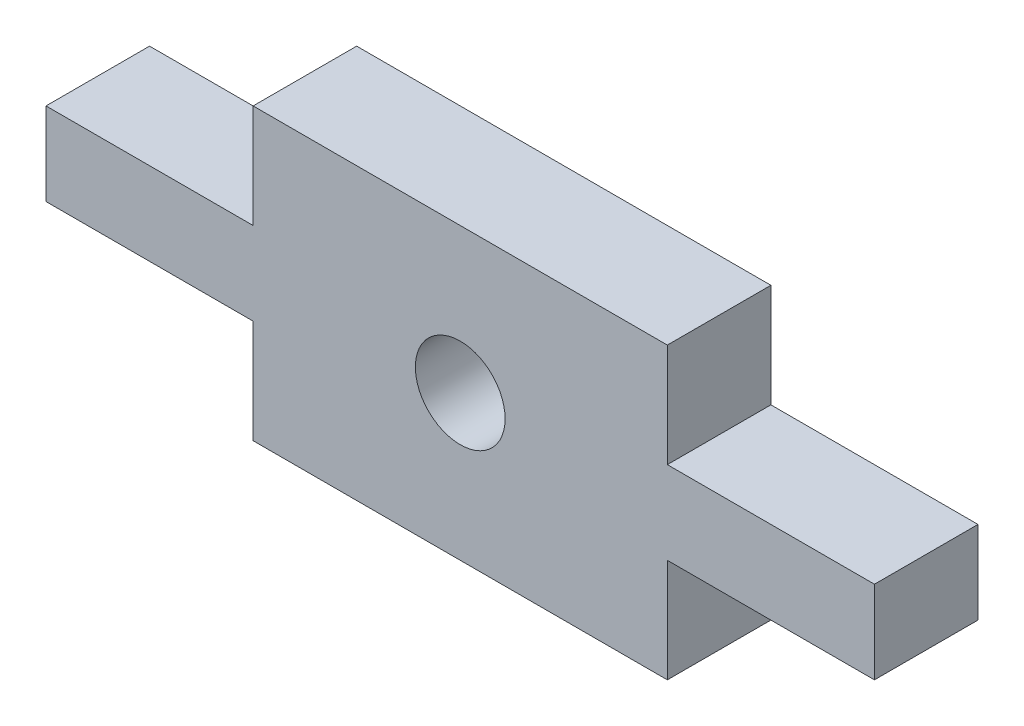
ISO-10303-21;
HEADER;
FILE_DESCRIPTION(('STEP AP214'),'2;1');
FILE_NAME('part.step','',(''),(''),'','','');
FILE_SCHEMA(('AUTOMOTIVE_DESIGN { 1 0 10303 214 1 1 1 1 }'));
ENDSEC;
DATA;
#1=APPLICATION_CONTEXT('core data for automotive mechanical design processes');
#2=APPLICATION_PROTOCOL_DEFINITION('international standard','automotive_design',2000,#1);
#3=PRODUCT_CONTEXT('',#1,'mechanical');
#4=PRODUCT('Part','Part','',(#3));
#5=PRODUCT_RELATED_PRODUCT_CATEGORY('part','',(#4));
#6=PRODUCT_DEFINITION_FORMATION('','',#4);
#7=PRODUCT_DEFINITION_CONTEXT('part definition',#1,'design');
#8=PRODUCT_DEFINITION('design','',#6,#7);
#9=PRODUCT_DEFINITION_SHAPE('','',#8);
#10=(LENGTH_UNIT() NAMED_UNIT(*) SI_UNIT(.MILLI.,.METRE.));
#11=(NAMED_UNIT(*) PLANE_ANGLE_UNIT() SI_UNIT($,.RADIAN.));
#12=(NAMED_UNIT(*) SI_UNIT($,.STERADIAN.) SOLID_ANGLE_UNIT());
#13=UNCERTAINTY_MEASURE_WITH_UNIT(LENGTH_MEASURE(1.E-05),#10,'distance_accuracy_value','');
#14=(GEOMETRIC_REPRESENTATION_CONTEXT(3) GLOBAL_UNCERTAINTY_ASSIGNED_CONTEXT((#13)) GLOBAL_UNIT_ASSIGNED_CONTEXT((#10,
#11,#12)) REPRESENTATION_CONTEXT('',''));
#15=CARTESIAN_POINT('',(0.,0.,0.));
#16=DIRECTION('',(0.,0.,1.));
#17=DIRECTION('',(1.,0.,0.));
#18=AXIS2_PLACEMENT_3D('',#15,#16,#17);
#19=CARTESIAN_POINT('',(0.,0.,3.));
#20=DIRECTION('',(0.,0.,1.));
#21=DIRECTION('',(1.,0.,0.));
#22=AXIS2_PLACEMENT_3D('',#19,#20,#21);
#23=PLANE('',#22);
#24=DIRECTION('',(0.,-1.,0.));
#25=VECTOR('',#24,1.);
#26=CARTESIAN_POINT('',(50.0001717042551,40.8001552944239,3.));
#27=LINE('',#26,#25);
#28=CARTESIAN_POINT('',(50.0001717042551,40.8001552944239,3.));
#29=VERTEX_POINT('',#28);
#30=CARTESIAN_POINT('',(50.0001717042551,37.8001552944239,3.));
#31=VERTEX_POINT('',#30);
#32=EDGE_CURVE('E178',#29,#31,#27,.T.);
#33=ORIENTED_EDGE('',*,*,#32,.T.);
#34=DIRECTION('',(1.,0.,0.));
#35=VECTOR('',#34,1.);
#36=CARTESIAN_POINT('',(50.0001717042551,37.8001552944239,3.));
#37=LINE('',#36,#35);
#38=CARTESIAN_POINT('',(62.0001717042551,37.8001552944239,3.));
#39=VERTEX_POINT('',#38);
#40=EDGE_CURVE('E106',#31,#39,#37,.T.);
#41=ORIENTED_EDGE('',*,*,#40,.T.);
#42=DIRECTION('',(0.,1.,0.));
#43=VECTOR('',#42,1.);
#44=CARTESIAN_POINT('',(62.0001717042551,40.8001552944239,3.));
#45=LINE('',#44,#43);
#46=CARTESIAN_POINT('',(62.0001717042551,40.8001552944239,3.));
#47=VERTEX_POINT('',#46);
#48=EDGE_CURVE('E205',#39,#47,#45,.T.);
#49=ORIENTED_EDGE('',*,*,#48,.T.);
#50=DIRECTION('',(1.,0.,0.));
#51=VECTOR('',#50,1.);
#52=CARTESIAN_POINT('',(67.9999669846486,40.8001552944239,3.));
#53=LINE('',#52,#51);
#54=CARTESIAN_POINT('',(67.9999669846486,40.8001552944239,3.));
#55=VERTEX_POINT('',#54);
#56=EDGE_CURVE('E224',#47,#55,#53,.T.);
#57=ORIENTED_EDGE('',*,*,#56,.T.);
#58=DIRECTION('',(0.,1.,0.));
#59=VECTOR('',#58,1.);
#60=CARTESIAN_POINT('',(67.9999669846486,40.8001552944239,3.));
#61=LINE('',#60,#59);
#62=CARTESIAN_POINT('',(67.9999669846486,43.2001552944239,3.));
#63=VERTEX_POINT('',#62);
#64=EDGE_CURVE('E221',#55,#63,#61,.T.);
#65=ORIENTED_EDGE('',*,*,#64,.T.);
#66=DIRECTION('',(-1.,0.,0.));
#67=VECTOR('',#66,1.);
#68=CARTESIAN_POINT('',(67.9999669846486,43.2001552944239,3.));
#69=LINE('',#68,#67);
#70=CARTESIAN_POINT('',(62.0001717042551,43.2001552944239,3.));
#71=VERTEX_POINT('',#70);
#72=EDGE_CURVE('E223',#63,#71,#69,.T.);
#73=ORIENTED_EDGE('',*,*,#72,.T.);
#74=DIRECTION('',(0.,1.,0.));
#75=VECTOR('',#74,1.);
#76=CARTESIAN_POINT('',(62.0001717042551,43.2001552944239,3.));
#77=LINE('',#76,#75);
#78=CARTESIAN_POINT('',(62.0001717042551,46.2001552944239,3.));
#79=VERTEX_POINT('',#78);
#80=EDGE_CURVE('E226',#71,#79,#77,.T.);
#81=ORIENTED_EDGE('',*,*,#80,.T.);
#82=DIRECTION('',(-1.,0.,0.));
#83=VECTOR('',#82,1.);
#84=CARTESIAN_POINT('',(62.0001717042551,46.2001552944239,3.));
#85=LINE('',#84,#83);
#86=CARTESIAN_POINT('',(50.0001717042551,46.2001552944239,3.));
#87=VERTEX_POINT('',#86);
#88=EDGE_CURVE('E232',#79,#87,#85,.T.);
#89=ORIENTED_EDGE('',*,*,#88,.T.);
#90=DIRECTION('',(0.,-1.,0.));
#91=VECTOR('',#90,1.);
#92=CARTESIAN_POINT('',(50.0001717042551,46.2001552944239,3.));
#93=LINE('',#92,#91);
#94=CARTESIAN_POINT('',(50.0001717042551,43.2001552944239,3.));
#95=VERTEX_POINT('',#94);
#96=EDGE_CURVE('E137',#87,#95,#93,.T.);
#97=ORIENTED_EDGE('',*,*,#96,.T.);
#98=DIRECTION('',(-1.,0.,0.));
#99=VECTOR('',#98,1.);
#100=CARTESIAN_POINT('',(50.0001717042551,43.2001552944239,3.));
#101=LINE('',#100,#99);
#102=CARTESIAN_POINT('',(44.0001363484727,43.2001552944239,3.));
#103=VERTEX_POINT('',#102);
#104=EDGE_CURVE('E131',#95,#103,#101,.T.);
#105=ORIENTED_EDGE('',*,*,#104,.T.);
#106=DIRECTION('',(0.,-1.,0.));
#107=VECTOR('',#106,1.);
#108=CARTESIAN_POINT('',(44.0001363484727,43.2001552944239,3.));
#109=LINE('',#108,#107);
#110=CARTESIAN_POINT('',(44.0001363484727,40.8001552944239,3.));
#111=VERTEX_POINT('',#110);
#112=EDGE_CURVE('E135',#103,#111,#109,.T.);
#113=ORIENTED_EDGE('',*,*,#112,.T.);
#114=DIRECTION('',(1.,0.,0.));
#115=VECTOR('',#114,1.);
#116=CARTESIAN_POINT('',(44.0001363484727,40.8001552944239,3.));
#117=LINE('',#116,#115);
#118=EDGE_CURVE('E51',#111,#29,#117,.T.);
#119=ORIENTED_EDGE('',*,*,#118,.T.);
#120=EDGE_LOOP('',(#33,#41,#49,#57,#65,#73,#81,#89,#97,#105,#113,#119));
#121=FACE_BOUND('',#120,.T.);
#122=CARTESIAN_POINT('',(56.0002777701432,42.0001552944239,3.));
#123=DIRECTION('',(0.,0.,1.));
#124=DIRECTION('',(1.,0.,0.));
#125=AXIS2_PLACEMENT_3D('',#122,#123,#124);
#126=CIRCLE('',#125,1.30000480673152);
#127=CARTESIAN_POINT('',(57.3002825768747,42.0001552944239,3.));
#128=VERTEX_POINT('',#127);
#129=EDGE_CURVE('E159',#128,#128,#126,.T.);
#130=ORIENTED_EDGE('',*,*,#129,.F.);
#131=EDGE_LOOP('',(#130));
#132=FACE_BOUND('',#131,.T.);
#133=ADVANCED_FACE('F34',(#121,#132),#23,.T.);
#134=CARTESIAN_POINT('',(0.,0.,0.));
#135=DIRECTION('',(0.,0.,1.));
#136=DIRECTION('',(1.,0.,0.));
#137=AXIS2_PLACEMENT_3D('',#134,#135,#136);
#138=PLANE('',#137);
#139=DIRECTION('',(0.,-1.,0.));
#140=VECTOR('',#139,1.);
#141=CARTESIAN_POINT('',(50.0001717042551,40.8001552944239,0.));
#142=LINE('',#141,#140);
#143=CARTESIAN_POINT('',(50.0001717042551,40.8001552944239,0.));
#144=VERTEX_POINT('',#143);
#145=CARTESIAN_POINT('',(50.0001717042551,37.8001552944239,0.));
#146=VERTEX_POINT('',#145);
#147=EDGE_CURVE('E155',#144,#146,#142,.T.);
#148=ORIENTED_EDGE('',*,*,#147,.F.);
#149=DIRECTION('',(1.,0.,0.));
#150=VECTOR('',#149,1.);
#151=CARTESIAN_POINT('',(44.0001363484727,40.8001552944239,0.));
#152=LINE('',#151,#150);
#153=CARTESIAN_POINT('',(44.0001363484727,40.8001552944239,0.));
#154=VERTEX_POINT('',#153);
#155=EDGE_CURVE('E98',#154,#144,#152,.T.);
#156=ORIENTED_EDGE('',*,*,#155,.F.);
#157=DIRECTION('',(0.,-1.,0.));
#158=VECTOR('',#157,1.);
#159=CARTESIAN_POINT('',(44.0001363484727,43.2001552944239,0.));
#160=LINE('',#159,#158);
#161=CARTESIAN_POINT('',(44.0001363484727,43.2001552944239,0.));
#162=VERTEX_POINT('',#161);
#163=EDGE_CURVE('E92',#162,#154,#160,.T.);
#164=ORIENTED_EDGE('',*,*,#163,.F.);
#165=DIRECTION('',(-1.,0.,0.));
#166=VECTOR('',#165,1.);
#167=CARTESIAN_POINT('',(50.0001717042551,43.2001552944239,0.));
#168=LINE('',#167,#166);
#169=CARTESIAN_POINT('',(50.0001717042551,43.2001552944239,0.));
#170=VERTEX_POINT('',#169);
#171=EDGE_CURVE('E145',#170,#162,#168,.T.);
#172=ORIENTED_EDGE('',*,*,#171,.F.);
#173=DIRECTION('',(0.,-1.,0.));
#174=VECTOR('',#173,1.);
#175=CARTESIAN_POINT('',(50.0001717042551,46.2001552944239,0.));
#176=LINE('',#175,#174);
#177=CARTESIAN_POINT('',(50.0001717042551,46.2001552944239,0.));
#178=VERTEX_POINT('',#177);
#179=EDGE_CURVE('E173',#178,#170,#176,.T.);
#180=ORIENTED_EDGE('',*,*,#179,.F.);
#181=DIRECTION('',(-1.,0.,0.));
#182=VECTOR('',#181,1.);
#183=CARTESIAN_POINT('',(62.0001717042551,46.2001552944239,0.));
#184=LINE('',#183,#182);
#185=CARTESIAN_POINT('',(62.0001717042551,46.2001552944239,0.));
#186=VERTEX_POINT('',#185);
#187=EDGE_CURVE('E171',#186,#178,#184,.T.);
#188=ORIENTED_EDGE('',*,*,#187,.F.);
#189=DIRECTION('',(0.,1.,0.));
#190=VECTOR('',#189,1.);
#191=CARTESIAN_POINT('',(62.0001717042551,43.2001552944239,0.));
#192=LINE('',#191,#190);
#193=CARTESIAN_POINT('',(62.0001717042551,43.2001552944239,0.));
#194=VERTEX_POINT('',#193);
#195=EDGE_CURVE('E169',#194,#186,#192,.T.);
#196=ORIENTED_EDGE('',*,*,#195,.F.);
#197=DIRECTION('',(-1.,0.,0.));
#198=VECTOR('',#197,1.);
#199=CARTESIAN_POINT('',(67.9999669846486,43.2001552944239,0.));
#200=LINE('',#199,#198);
#201=CARTESIAN_POINT('',(67.9999669846486,43.2001552944239,0.));
#202=VERTEX_POINT('',#201);
#203=EDGE_CURVE('E167',#202,#194,#200,.T.);
#204=ORIENTED_EDGE('',*,*,#203,.F.);
#205=DIRECTION('',(0.,1.,0.));
#206=VECTOR('',#205,1.);
#207=CARTESIAN_POINT('',(67.9999669846486,40.8001552944239,0.));
#208=LINE('',#207,#206);
#209=CARTESIAN_POINT('',(67.9999669846486,40.8001552944239,0.));
#210=VERTEX_POINT('',#209);
#211=EDGE_CURVE('E165',#210,#202,#208,.T.);
#212=ORIENTED_EDGE('',*,*,#211,.F.);
#213=DIRECTION('',(1.,0.,0.));
#214=VECTOR('',#213,1.);
#215=CARTESIAN_POINT('',(67.9999669846486,40.8001552944239,0.));
#216=LINE('',#215,#214);
#217=CARTESIAN_POINT('',(62.0001717042551,40.8001552944239,0.));
#218=VERTEX_POINT('',#217);
#219=EDGE_CURVE('E163',#218,#210,#216,.T.);
#220=ORIENTED_EDGE('',*,*,#219,.F.);
#221=DIRECTION('',(0.,1.,0.));
#222=VECTOR('',#221,1.);
#223=CARTESIAN_POINT('',(62.0001717042551,40.8001552944239,0.));
#224=LINE('',#223,#222);
#225=CARTESIAN_POINT('',(62.0001717042551,37.8001552944239,0.));
#226=VERTEX_POINT('',#225);
#227=EDGE_CURVE('E161',#226,#218,#224,.T.);
#228=ORIENTED_EDGE('',*,*,#227,.F.);
#229=DIRECTION('',(1.,0.,0.));
#230=VECTOR('',#229,1.);
#231=CARTESIAN_POINT('',(50.0001717042551,37.8001552944239,0.));
#232=LINE('',#231,#230);
#233=EDGE_CURVE('E158',#146,#226,#232,.T.);
#234=ORIENTED_EDGE('',*,*,#233,.F.);
#235=EDGE_LOOP('',(#148,#156,#164,#172,#180,#188,#196,#204,#212,#220,#228,#234));
#236=FACE_BOUND('',#235,.T.);
#237=CARTESIAN_POINT('',(56.0002777701432,42.0001552944239,0.));
#238=DIRECTION('',(0.,0.,1.));
#239=DIRECTION('',(1.,0.,0.));
#240=AXIS2_PLACEMENT_3D('',#237,#238,#239);
#241=CIRCLE('',#240,1.30000480673152);
#242=CARTESIAN_POINT('',(57.3002825768747,42.0001552944239,0.));
#243=VERTEX_POINT('',#242);
#244=EDGE_CURVE('E379',#243,#243,#241,.T.);
#245=ORIENTED_EDGE('',*,*,#244,.T.);
#246=EDGE_LOOP('',(#245));
#247=FACE_BOUND('',#246,.T.);
#248=ADVANCED_FACE('F209',(#236,#247),#138,.F.);
#249=CARTESIAN_POINT('',(50.0001717042551,40.8001552944239,3.));
#250=DIRECTION('',(1.,0.,0.));
#251=DIRECTION('',(0.,1.,0.));
#252=AXIS2_PLACEMENT_3D('',#249,#250,#251);
#253=PLANE('',#252);
#254=ORIENTED_EDGE('',*,*,#147,.T.);
#255=DIRECTION('',(0.,0.,-1.));
#256=VECTOR('',#255,1.);
#257=CARTESIAN_POINT('',(50.0001717042551,37.8001552944239,3.));
#258=LINE('',#257,#256);
#259=EDGE_CURVE('E11',#31,#146,#258,.T.);
#260=ORIENTED_EDGE('',*,*,#259,.F.);
#261=ORIENTED_EDGE('',*,*,#32,.F.);
#262=DIRECTION('',(0.,0.,-1.));
#263=VECTOR('',#262,1.);
#264=CARTESIAN_POINT('',(50.0001717042551,40.8001552944239,3.));
#265=LINE('',#264,#263);
#266=EDGE_CURVE('E151',#29,#144,#265,.T.);
#267=ORIENTED_EDGE('',*,*,#266,.T.);
#268=EDGE_LOOP('',(#254,#260,#261,#267));
#269=FACE_BOUND('',#268,.T.);
#270=ADVANCED_FACE('F36',(#269),#253,.F.);
#271=CARTESIAN_POINT('',(50.0001717042551,37.8001552944239,3.));
#272=DIRECTION('',(0.,1.,0.));
#273=DIRECTION('',(0.,0.,1.));
#274=AXIS2_PLACEMENT_3D('',#271,#272,#273);
#275=PLANE('',#274);
#276=ORIENTED_EDGE('',*,*,#233,.T.);
#277=DIRECTION('',(0.,0.,-1.));
#278=VECTOR('',#277,1.);
#279=CARTESIAN_POINT('',(62.0001717042551,37.8001552944239,3.));
#280=LINE('',#279,#278);
#281=EDGE_CURVE('E43',#39,#226,#280,.T.);
#282=ORIENTED_EDGE('',*,*,#281,.F.);
#283=ORIENTED_EDGE('',*,*,#40,.F.);
#284=ORIENTED_EDGE('',*,*,#259,.T.);
#285=EDGE_LOOP('',(#276,#282,#283,#284));
#286=FACE_BOUND('',#285,.T.);
#287=ADVANCED_FACE('F266',(#286),#275,.F.);
#288=CARTESIAN_POINT('',(62.0001717042551,40.8001552944239,3.));
#289=DIRECTION('',(-1.,0.,0.));
#290=DIRECTION('',(0.,0.,1.));
#291=AXIS2_PLACEMENT_3D('',#288,#289,#290);
#292=PLANE('',#291);
#293=ORIENTED_EDGE('',*,*,#227,.T.);
#294=DIRECTION('',(0.,0.,-1.));
#295=VECTOR('',#294,1.);
#296=CARTESIAN_POINT('',(62.0001717042551,40.8001552944239,3.));
#297=LINE('',#296,#295);
#298=EDGE_CURVE('E197',#47,#218,#297,.T.);
#299=ORIENTED_EDGE('',*,*,#298,.F.);
#300=ORIENTED_EDGE('',*,*,#48,.F.);
#301=ORIENTED_EDGE('',*,*,#281,.T.);
#302=EDGE_LOOP('',(#293,#299,#300,#301));
#303=FACE_BOUND('',#302,.T.);
#304=ADVANCED_FACE('F203',(#303),#292,.F.);
#305=CARTESIAN_POINT('',(67.9999669846486,40.8001552944239,3.));
#306=DIRECTION('',(0.,1.,0.));
#307=DIRECTION('',(0.,0.,1.));
#308=AXIS2_PLACEMENT_3D('',#305,#306,#307);
#309=PLANE('',#308);
#310=ORIENTED_EDGE('',*,*,#219,.T.);
#311=DIRECTION('',(0.,0.,-1.));
#312=VECTOR('',#311,1.);
#313=CARTESIAN_POINT('',(67.9999669846486,40.8001552944239,3.));
#314=LINE('',#313,#312);
#315=EDGE_CURVE('E194',#55,#210,#314,.T.);
#316=ORIENTED_EDGE('',*,*,#315,.F.);
#317=ORIENTED_EDGE('',*,*,#56,.F.);
#318=ORIENTED_EDGE('',*,*,#298,.T.);
#319=EDGE_LOOP('',(#310,#316,#317,#318));
#320=FACE_BOUND('',#319,.T.);
#321=ADVANCED_FACE('F215',(#320),#309,.F.);
#322=CARTESIAN_POINT('',(67.9999669846486,40.8001552944239,3.));
#323=DIRECTION('',(-1.,0.,0.));
#324=DIRECTION('',(0.,0.,1.));
#325=AXIS2_PLACEMENT_3D('',#322,#323,#324);
#326=PLANE('',#325);
#327=ORIENTED_EDGE('',*,*,#211,.T.);
#328=DIRECTION('',(0.,0.,-1.));
#329=VECTOR('',#328,1.);
#330=CARTESIAN_POINT('',(67.9999669846486,43.2001552944239,3.));
#331=LINE('',#330,#329);
#332=EDGE_CURVE('E191',#63,#202,#331,.T.);
#333=ORIENTED_EDGE('',*,*,#332,.F.);
#334=ORIENTED_EDGE('',*,*,#64,.F.);
#335=ORIENTED_EDGE('',*,*,#315,.T.);
#336=EDGE_LOOP('',(#327,#333,#334,#335));
#337=FACE_BOUND('',#336,.T.);
#338=ADVANCED_FACE('F219',(#337),#326,.F.);
#339=CARTESIAN_POINT('',(67.9999669846486,43.2001552944239,3.));
#340=DIRECTION('',(0.,-1.,0.));
#341=DIRECTION('',(0.,0.,-1.));
#342=AXIS2_PLACEMENT_3D('',#339,#340,#341);
#343=PLANE('',#342);
#344=ORIENTED_EDGE('',*,*,#203,.T.);
#345=DIRECTION('',(0.,0.,-1.));
#346=VECTOR('',#345,1.);
#347=CARTESIAN_POINT('',(62.0001717042551,43.2001552944239,3.));
#348=LINE('',#347,#346);
#349=EDGE_CURVE('E188',#71,#194,#348,.T.);
#350=ORIENTED_EDGE('',*,*,#349,.F.);
#351=ORIENTED_EDGE('',*,*,#72,.F.);
#352=ORIENTED_EDGE('',*,*,#332,.T.);
#353=EDGE_LOOP('',(#344,#350,#351,#352));
#354=FACE_BOUND('',#353,.T.);
#355=ADVANCED_FACE('F279',(#354),#343,.F.);
#356=CARTESIAN_POINT('',(62.0001717042551,43.2001552944239,3.));
#357=DIRECTION('',(-1.,0.,0.));
#358=DIRECTION('',(0.,-1.,0.));
#359=AXIS2_PLACEMENT_3D('',#356,#357,#358);
#360=PLANE('',#359);
#361=ORIENTED_EDGE('',*,*,#195,.T.);
#362=DIRECTION('',(0.,0.,-1.));
#363=VECTOR('',#362,1.);
#364=CARTESIAN_POINT('',(62.0001717042551,46.2001552944239,3.));
#365=LINE('',#364,#363);
#366=EDGE_CURVE('E185',#79,#186,#365,.T.);
#367=ORIENTED_EDGE('',*,*,#366,.F.);
#368=ORIENTED_EDGE('',*,*,#80,.F.);
#369=ORIENTED_EDGE('',*,*,#349,.T.);
#370=EDGE_LOOP('',(#361,#367,#368,#369));
#371=FACE_BOUND('',#370,.T.);
#372=ADVANCED_FACE('F282',(#371),#360,.F.);
#373=CARTESIAN_POINT('',(62.0001717042551,46.2001552944239,3.));
#374=DIRECTION('',(0.,-1.,0.));
#375=DIRECTION('',(0.,0.,-1.));
#376=AXIS2_PLACEMENT_3D('',#373,#374,#375);
#377=PLANE('',#376);
#378=ORIENTED_EDGE('',*,*,#187,.T.);
#379=DIRECTION('',(0.,0.,-1.));
#380=VECTOR('',#379,1.);
#381=CARTESIAN_POINT('',(50.0001717042551,46.2001552944239,3.));
#382=LINE('',#381,#380);
#383=EDGE_CURVE('E182',#87,#178,#382,.T.);
#384=ORIENTED_EDGE('',*,*,#383,.F.);
#385=ORIENTED_EDGE('',*,*,#88,.F.);
#386=ORIENTED_EDGE('',*,*,#366,.T.);
#387=EDGE_LOOP('',(#378,#384,#385,#386));
#388=FACE_BOUND('',#387,.T.);
#389=ADVANCED_FACE('F238',(#388),#377,.F.);
#390=CARTESIAN_POINT('',(50.0001717042551,46.2001552944239,3.));
#391=DIRECTION('',(1.,0.,0.));
#392=DIRECTION('',(0.,1.,0.));
#393=AXIS2_PLACEMENT_3D('',#390,#391,#392);
#394=PLANE('',#393);
#395=ORIENTED_EDGE('',*,*,#179,.T.);
#396=DIRECTION('',(0.,0.,-1.));
#397=VECTOR('',#396,1.);
#398=CARTESIAN_POINT('',(50.0001717042551,43.2001552944239,3.));
#399=LINE('',#398,#397);
#400=EDGE_CURVE('E146',#95,#170,#399,.T.);
#401=ORIENTED_EDGE('',*,*,#400,.F.);
#402=ORIENTED_EDGE('',*,*,#96,.F.);
#403=ORIENTED_EDGE('',*,*,#383,.T.);
#404=EDGE_LOOP('',(#395,#401,#402,#403));
#405=FACE_BOUND('',#404,.T.);
#406=ADVANCED_FACE('F242',(#405),#394,.F.);
#407=CARTESIAN_POINT('',(50.0001717042551,43.2001552944239,3.));
#408=DIRECTION('',(0.,-1.,0.));
#409=DIRECTION('',(0.,0.,-1.));
#410=AXIS2_PLACEMENT_3D('',#407,#408,#409);
#411=PLANE('',#410);
#412=ORIENTED_EDGE('',*,*,#171,.T.);
#413=DIRECTION('',(0.,0.,-1.));
#414=VECTOR('',#413,1.);
#415=CARTESIAN_POINT('',(44.0001363484727,43.2001552944239,3.));
#416=LINE('',#415,#414);
#417=EDGE_CURVE('E142',#103,#162,#416,.T.);
#418=ORIENTED_EDGE('',*,*,#417,.F.);
#419=ORIENTED_EDGE('',*,*,#104,.F.);
#420=ORIENTED_EDGE('',*,*,#400,.T.);
#421=EDGE_LOOP('',(#412,#418,#419,#420));
#422=FACE_BOUND('',#421,.T.);
#423=ADVANCED_FACE('F143',(#422),#411,.F.);
#424=CARTESIAN_POINT('',(44.0001363484727,43.2001552944239,3.));
#425=DIRECTION('',(1.,0.,0.));
#426=DIRECTION('',(0.,0.,-1.));
#427=AXIS2_PLACEMENT_3D('',#424,#425,#426);
#428=PLANE('',#427);
#429=ORIENTED_EDGE('',*,*,#163,.T.);
#430=DIRECTION('',(0.,0.,-1.));
#431=VECTOR('',#430,1.);
#432=CARTESIAN_POINT('',(44.0001363484727,40.8001552944239,3.));
#433=LINE('',#432,#431);
#434=EDGE_CURVE('E147',#111,#154,#433,.T.);
#435=ORIENTED_EDGE('',*,*,#434,.F.);
#436=ORIENTED_EDGE('',*,*,#112,.F.);
#437=ORIENTED_EDGE('',*,*,#417,.T.);
#438=EDGE_LOOP('',(#429,#435,#436,#437));
#439=FACE_BOUND('',#438,.T.);
#440=ADVANCED_FACE('F149',(#439),#428,.F.);
#441=CARTESIAN_POINT('',(44.0001363484727,40.8001552944239,3.));
#442=DIRECTION('',(0.,1.,0.));
#443=DIRECTION('',(0.,0.,1.));
#444=AXIS2_PLACEMENT_3D('',#441,#442,#443);
#445=PLANE('',#444);
#446=ORIENTED_EDGE('',*,*,#155,.T.);
#447=ORIENTED_EDGE('',*,*,#266,.F.);
#448=ORIENTED_EDGE('',*,*,#118,.F.);
#449=ORIENTED_EDGE('',*,*,#434,.T.);
#450=EDGE_LOOP('',(#446,#447,#448,#449));
#451=FACE_BOUND('',#450,.T.);
#452=ADVANCED_FACE('F246',(#451),#445,.F.);
#453=CARTESIAN_POINT('',(56.0002777701432,42.0001552944239,3.));
#454=DIRECTION('',(0.,0.,-1.));
#455=DIRECTION('',(-1.,0.,0.));
#456=AXIS2_PLACEMENT_3D('',#453,#454,#455);
#457=CYLINDRICAL_SURFACE('',#456,1.30000480673152);
#458=ORIENTED_EDGE('',*,*,#129,.T.);
#459=EDGE_LOOP('',(#458));
#460=FACE_BOUND('',#459,.T.);
#461=ORIENTED_EDGE('',*,*,#244,.F.);
#462=EDGE_LOOP('',(#461));
#463=FACE_BOUND('',#462,.T.);
#464=ADVANCED_FACE('F248',(#460,#463),#457,.F.);
#465=CLOSED_SHELL('',(#133,#248,#270,#287,#304,#321,#338,#355,#372,#389,#406,#423,#440,#452,#464));
#466=MANIFOLD_SOLID_BREP('B2',#465);
#467=ADVANCED_BREP_SHAPE_REPRESENTATION('',(#18,#466),#14);
#468=SHAPE_DEFINITION_REPRESENTATION(#9,#467);
ENDSEC;
END-ISO-10303-21;
